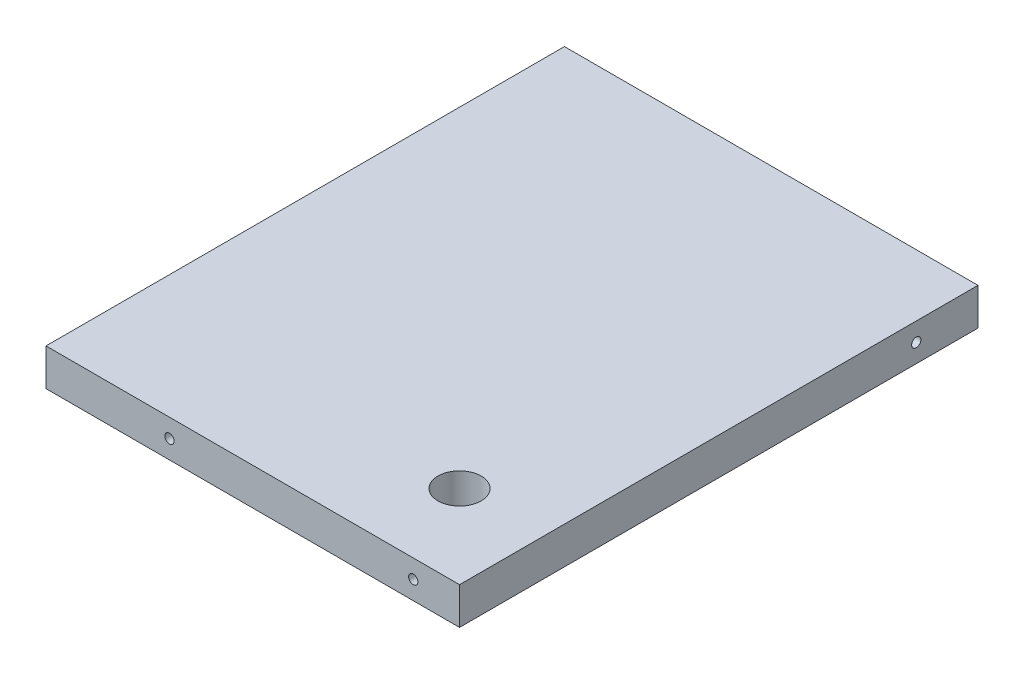
ISO-10303-21;
HEADER;
FILE_DESCRIPTION(('STEP AP214'),'2;1');
FILE_NAME('part.step','',(''),(''),'','','');
FILE_SCHEMA(('AUTOMOTIVE_DESIGN { 1 0 10303 214 1 1 1 1 }'));
ENDSEC;
DATA;
#1=APPLICATION_CONTEXT('core data for automotive mechanical design processes');
#2=APPLICATION_PROTOCOL_DEFINITION('international standard','automotive_design',2000,#1);
#3=PRODUCT_CONTEXT('',#1,'mechanical');
#4=PRODUCT('Part','Part','',(#3));
#5=PRODUCT_RELATED_PRODUCT_CATEGORY('part','',(#4));
#6=PRODUCT_DEFINITION_FORMATION('','',#4);
#7=PRODUCT_DEFINITION_CONTEXT('part definition',#1,'design');
#8=PRODUCT_DEFINITION('design','',#6,#7);
#9=PRODUCT_DEFINITION_SHAPE('','',#8);
#10=(LENGTH_UNIT() NAMED_UNIT(*) SI_UNIT(.MILLI.,.METRE.));
#11=(NAMED_UNIT(*) PLANE_ANGLE_UNIT() SI_UNIT($,.RADIAN.));
#12=(NAMED_UNIT(*) SI_UNIT($,.STERADIAN.) SOLID_ANGLE_UNIT());
#13=UNCERTAINTY_MEASURE_WITH_UNIT(LENGTH_MEASURE(1.E-05),#10,'distance_accuracy_value','');
#14=(GEOMETRIC_REPRESENTATION_CONTEXT(3) GLOBAL_UNCERTAINTY_ASSIGNED_CONTEXT((#13)) GLOBAL_UNIT_ASSIGNED_CONTEXT((#10,
#11,#12)) REPRESENTATION_CONTEXT('',''));
#15=CARTESIAN_POINT('',(0.,0.,0.));
#16=DIRECTION('',(0.,0.,1.));
#17=DIRECTION('',(1.,0.,0.));
#18=AXIS2_PLACEMENT_3D('',#15,#16,#17);
#19=CARTESIAN_POINT('',(0.,12.,0.));
#20=DIRECTION('',(0.,1.,0.));
#21=DIRECTION('',(0.,0.,1.));
#22=AXIS2_PLACEMENT_3D('',#19,#20,#21);
#23=PLANE('',#22);
#24=DIRECTION('',(0.,0.,1.));
#25=VECTOR('',#24,1.);
#26=CARTESIAN_POINT('',(-154.894163325294,12.,-212.256672781278));
#27=LINE('',#26,#25);
#28=CARTESIAN_POINT('',(-154.894163325294,12.,-212.256672781278));
#29=VERTEX_POINT('',#28);
#30=CARTESIAN_POINT('',(-154.894163325294,12.,-44.2566727812777));
#31=VERTEX_POINT('',#30);
#32=EDGE_CURVE('E84',#29,#31,#27,.T.);
#33=ORIENTED_EDGE('',*,*,#32,.T.);
#34=DIRECTION('',(1.,0.,0.));
#35=VECTOR('',#34,1.);
#36=CARTESIAN_POINT('',(-154.894163325294,12.,-44.2566727812777));
#37=LINE('',#36,#35);
#38=CARTESIAN_POINT('',(-20.8941633252944,12.,-44.2566727812777));
#39=VERTEX_POINT('',#38);
#40=EDGE_CURVE('E79',#31,#39,#37,.T.);
#41=ORIENTED_EDGE('',*,*,#40,.T.);
#42=DIRECTION('',(0.,0.,-1.));
#43=VECTOR('',#42,1.);
#44=CARTESIAN_POINT('',(-20.8941633252943,12.,-212.256672781278));
#45=LINE('',#44,#43);
#46=CARTESIAN_POINT('',(-20.8941633252943,12.,-212.256672781278));
#47=VERTEX_POINT('',#46);
#48=EDGE_CURVE('E82',#39,#47,#45,.T.);
#49=ORIENTED_EDGE('',*,*,#48,.T.);
#50=DIRECTION('',(-1.,0.,0.));
#51=VECTOR('',#50,1.);
#52=CARTESIAN_POINT('',(-154.894163325294,12.,-212.256672781278));
#53=LINE('',#52,#51);
#54=EDGE_CURVE('E49',#47,#29,#53,.T.);
#55=ORIENTED_EDGE('',*,*,#54,.T.);
#56=EDGE_LOOP('',(#33,#41,#49,#55));
#57=FACE_BOUND('',#56,.T.);
#58=CARTESIAN_POINT('',(-47.8941633252941,12.,-71.2566727812777));
#59=DIRECTION('',(0.,1.,0.));
#60=DIRECTION('',(0.,0.,1.));
#61=AXIS2_PLACEMENT_3D('',#58,#59,#60);
#62=CIRCLE('',#61,7.00000000000002);
#63=CARTESIAN_POINT('',(-47.8941633252941,12.,-64.2566727812777));
#64=VERTEX_POINT('',#63);
#65=EDGE_CURVE('E99',#64,#64,#62,.T.);
#66=ORIENTED_EDGE('',*,*,#65,.F.);
#67=EDGE_LOOP('',(#66));
#68=FACE_BOUND('',#67,.T.);
#69=ADVANCED_FACE('F32',(#57,#68),#23,.T.);
#70=CARTESIAN_POINT('',(0.,0.,0.));
#71=DIRECTION('',(0.,1.,0.));
#72=DIRECTION('',(0.,0.,1.));
#73=AXIS2_PLACEMENT_3D('',#70,#71,#72);
#74=PLANE('',#73);
#75=DIRECTION('',(0.,0.,1.));
#76=VECTOR('',#75,1.);
#77=CARTESIAN_POINT('',(-154.894163325294,0.,-212.256672781278));
#78=LINE('',#77,#76);
#79=CARTESIAN_POINT('',(-154.894163325294,0.,-212.256672781278));
#80=VERTEX_POINT('',#79);
#81=CARTESIAN_POINT('',(-154.894163325294,0.,-44.2566727812777));
#82=VERTEX_POINT('',#81);
#83=EDGE_CURVE('E96',#80,#82,#78,.T.);
#84=ORIENTED_EDGE('',*,*,#83,.F.);
#85=DIRECTION('',(-1.,0.,0.));
#86=VECTOR('',#85,1.);
#87=CARTESIAN_POINT('',(-154.894163325294,0.,-212.256672781278));
#88=LINE('',#87,#86);
#89=CARTESIAN_POINT('',(-20.8941633252943,0.,-212.256672781278));
#90=VERTEX_POINT('',#89);
#91=EDGE_CURVE('E72',#90,#80,#88,.T.);
#92=ORIENTED_EDGE('',*,*,#91,.F.);
#93=DIRECTION('',(0.,0.,-1.));
#94=VECTOR('',#93,1.);
#95=CARTESIAN_POINT('',(-20.8941633252943,0.,-212.256672781278));
#96=LINE('',#95,#94);
#97=CARTESIAN_POINT('',(-20.8941633252944,0.,-44.2566727812777));
#98=VERTEX_POINT('',#97);
#99=EDGE_CURVE('E66',#98,#90,#96,.T.);
#100=ORIENTED_EDGE('',*,*,#99,.F.);
#101=DIRECTION('',(1.,0.,0.));
#102=VECTOR('',#101,1.);
#103=CARTESIAN_POINT('',(-154.894163325294,0.,-44.2566727812777));
#104=LINE('',#103,#102);
#105=EDGE_CURVE('E88',#82,#98,#104,.T.);
#106=ORIENTED_EDGE('',*,*,#105,.F.);
#107=EDGE_LOOP('',(#84,#92,#100,#106));
#108=FACE_BOUND('',#107,.T.);
#109=CARTESIAN_POINT('',(-47.8941633252941,0.,-71.2566727812777));
#110=DIRECTION('',(0.,1.,0.));
#111=DIRECTION('',(0.,0.,1.));
#112=AXIS2_PLACEMENT_3D('',#109,#110,#111);
#113=CIRCLE('',#112,7.00000000000002);
#114=CARTESIAN_POINT('',(-47.8941633252941,0.,-64.2566727812777));
#115=VERTEX_POINT('',#114);
#116=EDGE_CURVE('E111',#115,#115,#113,.T.);
#117=ORIENTED_EDGE('',*,*,#116,.T.);
#118=EDGE_LOOP('',(#117));
#119=FACE_BOUND('',#118,.T.);
#120=ADVANCED_FACE('F107',(#108,#119),#74,.F.);
#121=CARTESIAN_POINT('',(-154.894163325294,12.,-212.256672781278));
#122=DIRECTION('',(1.,0.,0.));
#123=DIRECTION('',(0.,0.,-1.));
#124=AXIS2_PLACEMENT_3D('',#121,#122,#123);
#125=PLANE('',#124);
#126=ORIENTED_EDGE('',*,*,#83,.T.);
#127=DIRECTION('',(0.,-1.,0.));
#128=VECTOR('',#127,1.);
#129=CARTESIAN_POINT('',(-154.894163325294,12.,-44.2566727812777));
#130=LINE('',#129,#128);
#131=EDGE_CURVE('E11',#31,#82,#130,.T.);
#132=ORIENTED_EDGE('',*,*,#131,.F.);
#133=ORIENTED_EDGE('',*,*,#32,.F.);
#134=DIRECTION('',(0.,-1.,0.));
#135=VECTOR('',#134,1.);
#136=CARTESIAN_POINT('',(-154.894163325294,12.,-212.256672781278));
#137=LINE('',#136,#135);
#138=EDGE_CURVE('E92',#29,#80,#137,.T.);
#139=ORIENTED_EDGE('',*,*,#138,.T.);
#140=EDGE_LOOP('',(#126,#132,#133,#139));
#141=FACE_BOUND('',#140,.T.);
#142=ADVANCED_FACE('F34',(#141),#125,.F.);
#143=CARTESIAN_POINT('',(-154.894163325294,12.,-44.2566727812777));
#144=DIRECTION('',(0.,0.,-1.));
#145=DIRECTION('',(-1.,0.,0.));
#146=AXIS2_PLACEMENT_3D('',#143,#144,#145);
#147=PLANE('',#146);
#148=CARTESIAN_POINT('',(-35.8941633252944,6.,-44.2566727812777));
#149=DIRECTION('',(0.,0.,-1.));
#150=DIRECTION('',(-1.,0.,0.));
#151=AXIS2_PLACEMENT_3D('',#148,#149,#150);
#152=CIRCLE('',#151,1.5);
#153=CARTESIAN_POINT('',(-37.3941633252944,6.,-44.2566727812777));
#154=VERTEX_POINT('',#153);
#155=EDGE_CURVE('E123',#154,#154,#152,.T.);
#156=ORIENTED_EDGE('',*,*,#155,.T.);
#157=EDGE_LOOP('',(#156));
#158=FACE_BOUND('',#157,.T.);
#159=CARTESIAN_POINT('',(-114.894163325294,6.,-44.2566727812777));
#160=DIRECTION('',(0.,0.,-1.));
#161=DIRECTION('',(-1.,0.,0.));
#162=AXIS2_PLACEMENT_3D('',#159,#160,#161);
#163=CIRCLE('',#162,1.5);
#164=CARTESIAN_POINT('',(-116.394163325294,6.,-44.2566727812777));
#165=VERTEX_POINT('',#164);
#166=EDGE_CURVE('E117',#165,#165,#163,.T.);
#167=ORIENTED_EDGE('',*,*,#166,.T.);
#168=EDGE_LOOP('',(#167));
#169=FACE_BOUND('',#168,.T.);
#170=ORIENTED_EDGE('',*,*,#105,.T.);
#171=DIRECTION('',(0.,-1.,0.));
#172=VECTOR('',#171,1.);
#173=CARTESIAN_POINT('',(-20.8941633252944,12.,-44.2566727812777));
#174=LINE('',#173,#172);
#175=EDGE_CURVE('E41',#39,#98,#174,.T.);
#176=ORIENTED_EDGE('',*,*,#175,.F.);
#177=ORIENTED_EDGE('',*,*,#40,.F.);
#178=ORIENTED_EDGE('',*,*,#131,.T.);
#179=EDGE_LOOP('',(#170,#176,#177,#178));
#180=FACE_BOUND('',#179,.T.);
#181=ADVANCED_FACE('F87',(#158,#169,#180),#147,.F.);
#182=CARTESIAN_POINT('',(-20.8941633252943,12.,-212.256672781278));
#183=DIRECTION('',(-1.,0.,0.));
#184=DIRECTION('',(0.,0.,1.));
#185=AXIS2_PLACEMENT_3D('',#182,#183,#184);
#186=PLANE('',#185);
#187=CARTESIAN_POINT('',(-20.8941633252943,6.,-192.256672781278));
#188=DIRECTION('',(-1.,0.,0.));
#189=DIRECTION('',(0.,0.,1.));
#190=AXIS2_PLACEMENT_3D('',#187,#188,#189);
#191=CIRCLE('',#190,1.5);
#192=CARTESIAN_POINT('',(-20.8941633252943,6.,-190.756672781278));
#193=VERTEX_POINT('',#192);
#194=EDGE_CURVE('E129',#193,#193,#191,.T.);
#195=ORIENTED_EDGE('',*,*,#194,.T.);
#196=EDGE_LOOP('',(#195));
#197=FACE_BOUND('',#196,.T.);
#198=ORIENTED_EDGE('',*,*,#99,.T.);
#199=DIRECTION('',(0.,-1.,0.));
#200=VECTOR('',#199,1.);
#201=CARTESIAN_POINT('',(-20.8941633252943,12.,-212.256672781278));
#202=LINE('',#201,#200);
#203=EDGE_CURVE('E89',#47,#90,#202,.T.);
#204=ORIENTED_EDGE('',*,*,#203,.F.);
#205=ORIENTED_EDGE('',*,*,#48,.F.);
#206=ORIENTED_EDGE('',*,*,#175,.T.);
#207=EDGE_LOOP('',(#198,#204,#205,#206));
#208=FACE_BOUND('',#207,.T.);
#209=ADVANCED_FACE('F90',(#197,#208),#186,.F.);
#210=CARTESIAN_POINT('',(-154.894163325294,12.,-212.256672781278));
#211=DIRECTION('',(0.,0.,1.));
#212=DIRECTION('',(1.,0.,0.));
#213=AXIS2_PLACEMENT_3D('',#210,#211,#212);
#214=PLANE('',#213);
#215=ORIENTED_EDGE('',*,*,#91,.T.);
#216=ORIENTED_EDGE('',*,*,#138,.F.);
#217=ORIENTED_EDGE('',*,*,#54,.F.);
#218=ORIENTED_EDGE('',*,*,#203,.T.);
#219=EDGE_LOOP('',(#215,#216,#217,#218));
#220=FACE_BOUND('',#219,.T.);
#221=ADVANCED_FACE('F104',(#220),#214,.F.);
#222=CARTESIAN_POINT('',(-47.8941633252941,12.,-71.2566727812777));
#223=DIRECTION('',(0.,-1.,0.));
#224=DIRECTION('',(0.,0.,-1.));
#225=AXIS2_PLACEMENT_3D('',#222,#223,#224);
#226=CYLINDRICAL_SURFACE('',#225,7.00000000000002);
#227=ORIENTED_EDGE('',*,*,#65,.T.);
#228=EDGE_LOOP('',(#227));
#229=FACE_BOUND('',#228,.T.);
#230=ORIENTED_EDGE('',*,*,#116,.F.);
#231=EDGE_LOOP('',(#230));
#232=FACE_BOUND('',#231,.T.);
#233=ADVANCED_FACE('F153',(#229,#232),#226,.F.);
#234=CARTESIAN_POINT('',(-114.894163325294,6.,-64.2566727812777));
#235=DIRECTION('',(0.,0.,1.));
#236=DIRECTION('',(1.,0.,0.));
#237=AXIS2_PLACEMENT_3D('',#234,#235,#236);
#238=CYLINDRICAL_SURFACE('',#237,1.5);
#239=CARTESIAN_POINT('',(-114.894163325294,6.,-64.2566727812777));
#240=DIRECTION('',(0.,0.,-1.));
#241=DIRECTION('',(-1.,0.,0.));
#242=AXIS2_PLACEMENT_3D('',#239,#240,#241);
#243=CIRCLE('',#242,1.5);
#244=CARTESIAN_POINT('',(-116.394163325294,6.,-64.2566727812777));
#245=VERTEX_POINT('',#244);
#246=EDGE_CURVE('E114',#245,#245,#243,.T.);
#247=ORIENTED_EDGE('',*,*,#246,.T.);
#248=EDGE_LOOP('',(#247));
#249=FACE_BOUND('',#248,.T.);
#250=ORIENTED_EDGE('',*,*,#166,.F.);
#251=EDGE_LOOP('',(#250));
#252=FACE_BOUND('',#251,.T.);
#253=ADVANCED_FACE('F169',(#249,#252),#238,.F.);
#254=CARTESIAN_POINT('',(-114.894163325294,6.,-64.2566727812777));
#255=DIRECTION('',(0.,0.,-1.));
#256=DIRECTION('',(-1.,0.,0.));
#257=AXIS2_PLACEMENT_3D('',#254,#255,#256);
#258=PLANE('',#257);
#259=ORIENTED_EDGE('',*,*,#246,.F.);
#260=EDGE_LOOP('',(#259));
#261=FACE_BOUND('',#260,.T.);
#262=ADVANCED_FACE('F171',(#261),#258,.F.);
#263=CARTESIAN_POINT('',(-35.8941633252944,6.,-64.2566727812777));
#264=DIRECTION('',(0.,0.,1.));
#265=DIRECTION('',(1.,0.,0.));
#266=AXIS2_PLACEMENT_3D('',#263,#264,#265);
#267=CYLINDRICAL_SURFACE('',#266,1.5);
#268=CARTESIAN_POINT('',(-35.8941633252944,6.,-64.2566727812777));
#269=DIRECTION('',(0.,0.,-1.));
#270=DIRECTION('',(-1.,0.,0.));
#271=AXIS2_PLACEMENT_3D('',#268,#269,#270);
#272=CIRCLE('',#271,1.5);
#273=CARTESIAN_POINT('',(-37.3941633252944,6.,-64.2566727812777));
#274=VERTEX_POINT('',#273);
#275=EDGE_CURVE('E120',#274,#274,#272,.T.);
#276=ORIENTED_EDGE('',*,*,#275,.T.);
#277=EDGE_LOOP('',(#276));
#278=FACE_BOUND('',#277,.T.);
#279=ORIENTED_EDGE('',*,*,#155,.F.);
#280=EDGE_LOOP('',(#279));
#281=FACE_BOUND('',#280,.T.);
#282=ADVANCED_FACE('F177',(#278,#281),#267,.F.);
#283=CARTESIAN_POINT('',(-35.8941633252944,6.,-64.2566727812777));
#284=DIRECTION('',(0.,0.,-1.));
#285=DIRECTION('',(-1.,0.,0.));
#286=AXIS2_PLACEMENT_3D('',#283,#284,#285);
#287=PLANE('',#286);
#288=ORIENTED_EDGE('',*,*,#275,.F.);
#289=EDGE_LOOP('',(#288));
#290=FACE_BOUND('',#289,.T.);
#291=ADVANCED_FACE('F144',(#290),#287,.F.);
#292=CARTESIAN_POINT('',(-40.8941633252943,6.,-192.256672781278));
#293=DIRECTION('',(1.,0.,0.));
#294=DIRECTION('',(0.,0.,-1.));
#295=AXIS2_PLACEMENT_3D('',#292,#293,#294);
#296=CYLINDRICAL_SURFACE('',#295,1.5);
#297=CARTESIAN_POINT('',(-40.8941633252943,6.,-192.256672781278));
#298=DIRECTION('',(-1.,0.,0.));
#299=DIRECTION('',(0.,0.,1.));
#300=AXIS2_PLACEMENT_3D('',#297,#298,#299);
#301=CIRCLE('',#300,1.5);
#302=CARTESIAN_POINT('',(-40.8941633252943,6.,-190.756672781278));
#303=VERTEX_POINT('',#302);
#304=EDGE_CURVE('E126',#303,#303,#301,.T.);
#305=ORIENTED_EDGE('',*,*,#304,.T.);
#306=EDGE_LOOP('',(#305));
#307=FACE_BOUND('',#306,.T.);
#308=ORIENTED_EDGE('',*,*,#194,.F.);
#309=EDGE_LOOP('',(#308));
#310=FACE_BOUND('',#309,.T.);
#311=ADVANCED_FACE('F135',(#307,#310),#296,.F.);
#312=CARTESIAN_POINT('',(-40.8941633252943,6.,-192.256672781278));
#313=DIRECTION('',(-1.,0.,0.));
#314=DIRECTION('',(0.,0.,1.));
#315=AXIS2_PLACEMENT_3D('',#312,#313,#314);
#316=PLANE('',#315);
#317=ORIENTED_EDGE('',*,*,#304,.F.);
#318=EDGE_LOOP('',(#317));
#319=FACE_BOUND('',#318,.T.);
#320=ADVANCED_FACE('F138',(#319),#316,.F.);
#321=CLOSED_SHELL('',(#69,#120,#142,#181,#209,#221,#233,#253,#262,#282,#291,#311,#320));
#322=MANIFOLD_SOLID_BREP('B2',#321);
#323=ADVANCED_BREP_SHAPE_REPRESENTATION('',(#18,#322),#14);
#324=SHAPE_DEFINITION_REPRESENTATION(#9,#323);
ENDSEC;
END-ISO-10303-21;
